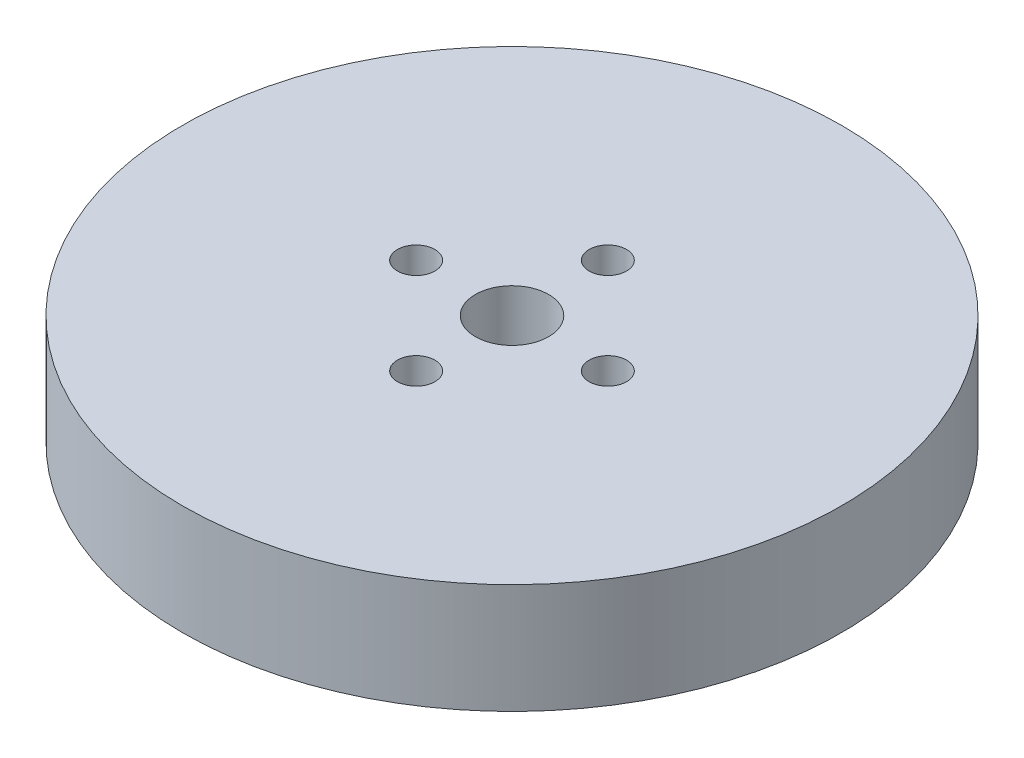
ISO-10303-21;
HEADER;
FILE_DESCRIPTION(('STEP AP214'),'2;1');
FILE_NAME('part.step','',(''),(''),'','','');
FILE_SCHEMA(('AUTOMOTIVE_DESIGN { 1 0 10303 214 1 1 1 1 }'));
ENDSEC;
DATA;
#1=APPLICATION_CONTEXT('core data for automotive mechanical design processes');
#2=APPLICATION_PROTOCOL_DEFINITION('international standard','automotive_design',2000,#1);
#3=PRODUCT_CONTEXT('',#1,'mechanical');
#4=PRODUCT('Part','Part','',(#3));
#5=PRODUCT_RELATED_PRODUCT_CATEGORY('part','',(#4));
#6=PRODUCT_DEFINITION_FORMATION('','',#4);
#7=PRODUCT_DEFINITION_CONTEXT('part definition',#1,'design');
#8=PRODUCT_DEFINITION('design','',#6,#7);
#9=PRODUCT_DEFINITION_SHAPE('','',#8);
#10=(LENGTH_UNIT() NAMED_UNIT(*) SI_UNIT(.MILLI.,.METRE.));
#11=(NAMED_UNIT(*) PLANE_ANGLE_UNIT() SI_UNIT($,.RADIAN.));
#12=(NAMED_UNIT(*) SI_UNIT($,.STERADIAN.) SOLID_ANGLE_UNIT());
#13=UNCERTAINTY_MEASURE_WITH_UNIT(LENGTH_MEASURE(1.E-05),#10,'distance_accuracy_value','');
#14=(GEOMETRIC_REPRESENTATION_CONTEXT(3) GLOBAL_UNCERTAINTY_ASSIGNED_CONTEXT((#13)) GLOBAL_UNIT_ASSIGNED_CONTEXT((#10,
#11,#12)) REPRESENTATION_CONTEXT('',''));
#15=CARTESIAN_POINT('',(0.,0.,0.));
#16=DIRECTION('',(0.,0.,1.));
#17=DIRECTION('',(1.,0.,0.));
#18=AXIS2_PLACEMENT_3D('',#15,#16,#17);
#19=CARTESIAN_POINT('',(0.,30.,0.));
#20=DIRECTION('',(0.,-1.,0.));
#21=DIRECTION('',(0.,0.,-1.));
#22=AXIS2_PLACEMENT_3D('',#19,#20,#21);
#23=CYLINDRICAL_SURFACE('',#22,90.);
#24=CARTESIAN_POINT('',(0.,30.,0.));
#25=DIRECTION('',(0.,1.,0.));
#26=DIRECTION('',(0.,0.,1.));
#27=AXIS2_PLACEMENT_3D('',#24,#25,#26);
#28=CIRCLE('',#27,90.);
#29=CARTESIAN_POINT('',(0.,30.,90.));
#30=VERTEX_POINT('',#29);
#31=EDGE_CURVE('E10',#30,#30,#28,.T.);
#32=ORIENTED_EDGE('',*,*,#31,.F.);
#33=EDGE_LOOP('',(#32));
#34=FACE_BOUND('',#33,.T.);
#35=CARTESIAN_POINT('',(0.,0.,0.));
#36=DIRECTION('',(0.,1.,0.));
#37=DIRECTION('',(0.,0.,1.));
#38=AXIS2_PLACEMENT_3D('',#35,#36,#37);
#39=CIRCLE('',#38,90.);
#40=CARTESIAN_POINT('',(0.,0.,90.));
#41=VERTEX_POINT('',#40);
#42=EDGE_CURVE('E37',#41,#41,#39,.T.);
#43=ORIENTED_EDGE('',*,*,#42,.T.);
#44=EDGE_LOOP('',(#43));
#45=FACE_BOUND('',#44,.T.);
#46=ADVANCED_FACE('F40',(#34,#45),#23,.T.);
#47=CARTESIAN_POINT('',(0.,30.,0.));
#48=DIRECTION('',(0.,1.,0.));
#49=DIRECTION('',(0.,0.,1.));
#50=AXIS2_PLACEMENT_3D('',#47,#48,#49);
#51=PLANE('',#50);
#52=CARTESIAN_POINT('',(0.,30.,26.1715033190232));
#53=DIRECTION('',(0.,1.,0.));
#54=DIRECTION('',(1.,0.,0.));
#55=AXIS2_PLACEMENT_3D('',#52,#53,#54);
#56=CIRCLE('',#55,5.11908659237439);
#57=CARTESIAN_POINT('',(5.11908659237448,30.,26.1715033190232));
#58=VERTEX_POINT('',#57);
#59=EDGE_CURVE('E71',#58,#58,#56,.T.);
#60=ORIENTED_EDGE('',*,*,#59,.F.);
#61=EDGE_LOOP('',(#60));
#62=FACE_BOUND('',#61,.T.);
#63=CARTESIAN_POINT('',(26.1715033190232,30.,0.));
#64=DIRECTION('',(0.,1.,0.));
#65=DIRECTION('',(0.,0.,-1.));
#66=AXIS2_PLACEMENT_3D('',#63,#64,#65);
#67=CIRCLE('',#66,5.11908659237439);
#68=CARTESIAN_POINT('',(26.1715033190232,30.,-5.11908659237439));
#69=VERTEX_POINT('',#68);
#70=EDGE_CURVE('E70',#69,#69,#67,.T.);
#71=ORIENTED_EDGE('',*,*,#70,.F.);
#72=EDGE_LOOP('',(#71));
#73=FACE_BOUND('',#72,.T.);
#74=CARTESIAN_POINT('',(-2.74131946343522E-13,30.,-26.1715033190232));
#75=DIRECTION('',(0.,1.,0.));
#76=DIRECTION('',(-1.,0.,0.));
#77=AXIS2_PLACEMENT_3D('',#74,#75,#76);
#78=CIRCLE('',#77,5.11908659237439);
#79=CARTESIAN_POINT('',(-5.11908659237467,30.,-26.1715033190232));
#80=VERTEX_POINT('',#79);
#81=EDGE_CURVE('E61',#80,#80,#78,.T.);
#82=ORIENTED_EDGE('',*,*,#81,.F.);
#83=EDGE_LOOP('',(#82));
#84=FACE_BOUND('',#83,.T.);
#85=CARTESIAN_POINT('',(-26.1715033190232,30.,0.));
#86=DIRECTION('',(0.,1.,0.));
#87=DIRECTION('',(0.,0.,1.));
#88=AXIS2_PLACEMENT_3D('',#85,#86,#87);
#89=CIRCLE('',#88,5.11908659237439);
#90=CARTESIAN_POINT('',(-26.1715033190232,30.,5.11908659237439));
#91=VERTEX_POINT('',#90);
#92=EDGE_CURVE('E54',#91,#91,#89,.T.);
#93=ORIENTED_EDGE('',*,*,#92,.F.);
#94=EDGE_LOOP('',(#93));
#95=FACE_BOUND('',#94,.T.);
#96=CARTESIAN_POINT('',(0.,30.,0.));
#97=DIRECTION('',(0.,1.,0.));
#98=DIRECTION('',(0.,0.,1.));
#99=AXIS2_PLACEMENT_3D('',#96,#97,#98);
#100=CIRCLE('',#99,10.);
#101=CARTESIAN_POINT('',(0.,30.,10.));
#102=VERTEX_POINT('',#101);
#103=EDGE_CURVE('E50',#102,#102,#100,.T.);
#104=ORIENTED_EDGE('',*,*,#103,.F.);
#105=EDGE_LOOP('',(#104));
#106=FACE_BOUND('',#105,.T.);
#107=ORIENTED_EDGE('',*,*,#31,.T.);
#108=EDGE_LOOP('',(#107));
#109=FACE_BOUND('',#108,.T.);
#110=ADVANCED_FACE('F86',(#62,#73,#84,#95,#106,#109),#51,.T.);
#111=CARTESIAN_POINT('',(0.,0.,0.));
#112=DIRECTION('',(0.,1.,0.));
#113=DIRECTION('',(0.,0.,1.));
#114=AXIS2_PLACEMENT_3D('',#111,#112,#113);
#115=PLANE('',#114);
#116=CARTESIAN_POINT('',(0.,0.,0.));
#117=DIRECTION('',(0.,1.,0.));
#118=DIRECTION('',(0.,0.,1.));
#119=AXIS2_PLACEMENT_3D('',#116,#117,#118);
#120=CIRCLE('',#119,10.);
#121=CARTESIAN_POINT('',(0.,0.,10.));
#122=VERTEX_POINT('',#121);
#123=EDGE_CURVE('E47',#122,#122,#120,.T.);
#124=ORIENTED_EDGE('',*,*,#123,.T.);
#125=EDGE_LOOP('',(#124));
#126=FACE_BOUND('',#125,.T.);
#127=ORIENTED_EDGE('',*,*,#42,.F.);
#128=EDGE_LOOP('',(#127));
#129=FACE_BOUND('',#128,.T.);
#130=ADVANCED_FACE('F93',(#126,#129),#115,.F.);
#131=CARTESIAN_POINT('',(0.,30.,0.));
#132=DIRECTION('',(0.,-1.,0.));
#133=DIRECTION('',(0.,0.,-1.));
#134=AXIS2_PLACEMENT_3D('',#131,#132,#133);
#135=CYLINDRICAL_SURFACE('',#134,10.);
#136=ORIENTED_EDGE('',*,*,#103,.T.);
#137=EDGE_LOOP('',(#136));
#138=FACE_BOUND('',#137,.T.);
#139=ORIENTED_EDGE('',*,*,#123,.F.);
#140=EDGE_LOOP('',(#139));
#141=FACE_BOUND('',#140,.T.);
#142=ADVANCED_FACE('F101',(#138,#141),#135,.F.);
#143=CARTESIAN_POINT('',(-26.1715033190232,1.21405982801995,0.));
#144=DIRECTION('',(0.,1.,0.));
#145=DIRECTION('',(0.,0.,1.));
#146=AXIS2_PLACEMENT_3D('',#143,#144,#145);
#147=CYLINDRICAL_SURFACE('',#146,5.11908659237439);
#148=CARTESIAN_POINT('',(-26.1715033190232,1.21405982801995,0.));
#149=DIRECTION('',(0.,1.,0.));
#150=DIRECTION('',(0.,0.,1.));
#151=AXIS2_PLACEMENT_3D('',#148,#149,#150);
#152=CIRCLE('',#151,5.11908659237439);
#153=CARTESIAN_POINT('',(-26.1715033190232,1.21405982801995,5.11908659237439));
#154=VERTEX_POINT('',#153);
#155=EDGE_CURVE('E55',#154,#154,#152,.T.);
#156=ORIENTED_EDGE('',*,*,#155,.F.);
#157=EDGE_LOOP('',(#156));
#158=FACE_BOUND('',#157,.T.);
#159=ORIENTED_EDGE('',*,*,#92,.T.);
#160=EDGE_LOOP('',(#159));
#161=FACE_BOUND('',#160,.T.);
#162=ADVANCED_FACE('F102',(#158,#161),#147,.F.);
#163=CARTESIAN_POINT('',(-26.1715033190232,1.21405982801995,0.));
#164=DIRECTION('',(0.,1.,0.));
#165=DIRECTION('',(0.,0.,1.));
#166=AXIS2_PLACEMENT_3D('',#163,#164,#165);
#167=PLANE('',#166);
#168=ORIENTED_EDGE('',*,*,#155,.T.);
#169=EDGE_LOOP('',(#168));
#170=FACE_BOUND('',#169,.T.);
#171=ADVANCED_FACE('F133',(#170),#167,.T.);
#172=CARTESIAN_POINT('',(-2.74131946343522E-13,1.21405982801995,-26.1715033190232));
#173=DIRECTION('',(0.,1.,0.));
#174=DIRECTION('',(0.,0.,1.));
#175=AXIS2_PLACEMENT_3D('',#172,#173,#174);
#176=CYLINDRICAL_SURFACE('',#175,5.11908659237439);
#177=CARTESIAN_POINT('',(-2.74131946343522E-13,1.21405982801995,-26.1715033190232));
#178=DIRECTION('',(0.,1.,0.));
#179=DIRECTION('',(-1.,0.,0.));
#180=AXIS2_PLACEMENT_3D('',#177,#178,#179);
#181=CIRCLE('',#180,5.11908659237439);
#182=CARTESIAN_POINT('',(-5.11908659237467,1.21405982801995,-26.1715033190232));
#183=VERTEX_POINT('',#182);
#184=EDGE_CURVE('E63',#183,#183,#181,.T.);
#185=ORIENTED_EDGE('',*,*,#184,.F.);
#186=EDGE_LOOP('',(#185));
#187=FACE_BOUND('',#186,.T.);
#188=ORIENTED_EDGE('',*,*,#81,.T.);
#189=EDGE_LOOP('',(#188));
#190=FACE_BOUND('',#189,.T.);
#191=ADVANCED_FACE('F142',(#187,#190),#176,.F.);
#192=CARTESIAN_POINT('',(-2.74131946343522E-13,1.21405982801995,-26.1715033190232));
#193=DIRECTION('',(0.,1.,0.));
#194=DIRECTION('',(-1.,0.,0.));
#195=AXIS2_PLACEMENT_3D('',#192,#193,#194);
#196=PLANE('',#195);
#197=ORIENTED_EDGE('',*,*,#184,.T.);
#198=EDGE_LOOP('',(#197));
#199=FACE_BOUND('',#198,.T.);
#200=ADVANCED_FACE('F156',(#199),#196,.T.);
#201=CARTESIAN_POINT('',(26.1715033190232,1.21405982801995,0.));
#202=DIRECTION('',(0.,1.,0.));
#203=DIRECTION('',(0.,0.,1.));
#204=AXIS2_PLACEMENT_3D('',#201,#202,#203);
#205=CYLINDRICAL_SURFACE('',#204,5.11908659237439);
#206=CARTESIAN_POINT('',(26.1715033190232,1.21405982801995,0.));
#207=DIRECTION('',(0.,1.,0.));
#208=DIRECTION('',(0.,0.,-1.));
#209=AXIS2_PLACEMENT_3D('',#206,#207,#208);
#210=CIRCLE('',#209,5.11908659237439);
#211=CARTESIAN_POINT('',(26.1715033190232,1.21405982801995,-5.11908659237439));
#212=VERTEX_POINT('',#211);
#213=EDGE_CURVE('E69',#212,#212,#210,.T.);
#214=ORIENTED_EDGE('',*,*,#213,.F.);
#215=EDGE_LOOP('',(#214));
#216=FACE_BOUND('',#215,.T.);
#217=ORIENTED_EDGE('',*,*,#70,.T.);
#218=EDGE_LOOP('',(#217));
#219=FACE_BOUND('',#218,.T.);
#220=ADVANCED_FACE('F164',(#216,#219),#205,.F.);
#221=CARTESIAN_POINT('',(26.1715033190232,1.21405982801995,0.));
#222=DIRECTION('',(0.,1.,0.));
#223=DIRECTION('',(0.,0.,-1.));
#224=AXIS2_PLACEMENT_3D('',#221,#222,#223);
#225=PLANE('',#224);
#226=ORIENTED_EDGE('',*,*,#213,.T.);
#227=EDGE_LOOP('',(#226));
#228=FACE_BOUND('',#227,.T.);
#229=ADVANCED_FACE('F83',(#228),#225,.T.);
#230=CARTESIAN_POINT('',(0.,1.21405982801995,26.1715033190232));
#231=DIRECTION('',(0.,1.,0.));
#232=DIRECTION('',(0.,0.,1.));
#233=AXIS2_PLACEMENT_3D('',#230,#231,#232);
#234=CYLINDRICAL_SURFACE('',#233,5.11908659237439);
#235=CARTESIAN_POINT('',(0.,1.21405982801995,26.1715033190232));
#236=DIRECTION('',(0.,1.,0.));
#237=DIRECTION('',(1.,0.,0.));
#238=AXIS2_PLACEMENT_3D('',#235,#236,#237);
#239=CIRCLE('',#238,5.11908659237439);
#240=CARTESIAN_POINT('',(5.11908659237448,1.21405982801995,26.1715033190232));
#241=VERTEX_POINT('',#240);
#242=EDGE_CURVE('E59',#241,#241,#239,.T.);
#243=ORIENTED_EDGE('',*,*,#242,.F.);
#244=EDGE_LOOP('',(#243));
#245=FACE_BOUND('',#244,.T.);
#246=ORIENTED_EDGE('',*,*,#59,.T.);
#247=EDGE_LOOP('',(#246));
#248=FACE_BOUND('',#247,.T.);
#249=ADVANCED_FACE('F81',(#245,#248),#234,.F.);
#250=CARTESIAN_POINT('',(0.,1.21405982801995,26.1715033190232));
#251=DIRECTION('',(0.,1.,0.));
#252=DIRECTION('',(1.,0.,0.));
#253=AXIS2_PLACEMENT_3D('',#250,#251,#252);
#254=PLANE('',#253);
#255=ORIENTED_EDGE('',*,*,#242,.T.);
#256=EDGE_LOOP('',(#255));
#257=FACE_BOUND('',#256,.T.);
#258=ADVANCED_FACE('F78',(#257),#254,.T.);
#259=CLOSED_SHELL('',(#46,#110,#130,#142,#162,#171,#191,#200,#220,#229,#249,#258));
#260=MANIFOLD_SOLID_BREP('B2',#259);
#261=ADVANCED_BREP_SHAPE_REPRESENTATION('',(#18,#260),#14);
#262=SHAPE_DEFINITION_REPRESENTATION(#9,#261);
ENDSEC;
END-ISO-10303-21;
